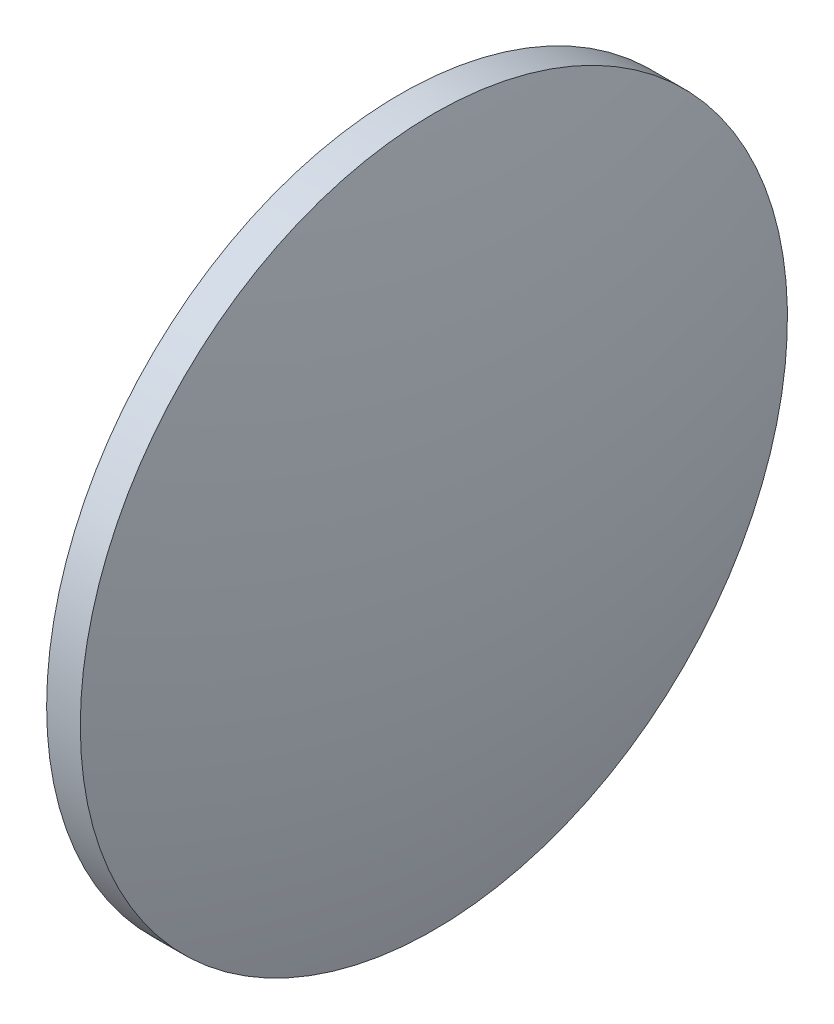
ISO-10303-21;
HEADER;
FILE_DESCRIPTION(('STEP AP214'),'2;1');
FILE_NAME('part.step','',(''),(''),'','','');
FILE_SCHEMA(('AUTOMOTIVE_DESIGN { 1 0 10303 214 1 1 1 1 }'));
ENDSEC;
DATA;
#1=APPLICATION_CONTEXT('core data for automotive mechanical design processes');
#2=APPLICATION_PROTOCOL_DEFINITION('international standard','automotive_design',2000,#1);
#3=PRODUCT_CONTEXT('',#1,'mechanical');
#4=PRODUCT('Part','Part','',(#3));
#5=PRODUCT_RELATED_PRODUCT_CATEGORY('part','',(#4));
#6=PRODUCT_DEFINITION_FORMATION('','',#4);
#7=PRODUCT_DEFINITION_CONTEXT('part definition',#1,'design');
#8=PRODUCT_DEFINITION('design','',#6,#7);
#9=PRODUCT_DEFINITION_SHAPE('','',#8);
#10=(LENGTH_UNIT() NAMED_UNIT(*) SI_UNIT(.MILLI.,.METRE.));
#11=(NAMED_UNIT(*) PLANE_ANGLE_UNIT() SI_UNIT($,.RADIAN.));
#12=(NAMED_UNIT(*) SI_UNIT($,.STERADIAN.) SOLID_ANGLE_UNIT());
#13=UNCERTAINTY_MEASURE_WITH_UNIT(LENGTH_MEASURE(1.E-05),#10,'distance_accuracy_value','');
#14=(GEOMETRIC_REPRESENTATION_CONTEXT(3) GLOBAL_UNCERTAINTY_ASSIGNED_CONTEXT((#13)) GLOBAL_UNIT_ASSIGNED_CONTEXT((#10,
#11,#12)) REPRESENTATION_CONTEXT('',''));
#15=CARTESIAN_POINT('',(0.,0.,0.));
#16=DIRECTION('',(0.,0.,1.));
#17=DIRECTION('',(1.,0.,0.));
#18=AXIS2_PLACEMENT_3D('',#15,#16,#17);
#19=CARTESIAN_POINT('',(344.84011655724,57.8954623100923,0.));
#20=DIRECTION('',(-1.,0.,0.));
#21=DIRECTION('',(0.,1.,0.));
#22=AXIS2_PLACEMENT_3D('',#19,#20,#21);
#23=SPHERICAL_SURFACE('',#22,129.161538461538);
#24=CARTESIAN_POINT('',(470.101655018778,57.8954623100924,0.));
#25=DIRECTION('',(-1.,0.,0.));
#26=DIRECTION('',(0.,0.,1.));
#27=AXIS2_PLACEMENT_3D('',#24,#25,#26);
#28=CIRCLE('',#27,31.5);
#29=CARTESIAN_POINT('',(470.101655018778,57.8954623100924,31.5));
#30=VERTEX_POINT('',#29);
#31=EDGE_CURVE('E10',#30,#30,#28,.T.);
#32=ORIENTED_EDGE('',*,*,#31,.F.);
#33=EDGE_LOOP('',(#32));
#34=FACE_BOUND('',#33,.T.);
#35=ADVANCED_FACE('F35',(#34),#23,.T.);
#36=CARTESIAN_POINT('',(458.332020754546,57.8954623100924,0.));
#37=DIRECTION('',(-1.,0.,0.));
#38=DIRECTION('',(0.,0.,1.));
#39=AXIS2_PLACEMENT_3D('',#36,#37,#38);
#40=CYLINDRICAL_SURFACE('',#39,31.5);
#41=CARTESIAN_POINT('',(467.101655018778,57.8954623100924,0.));
#42=DIRECTION('',(-1.,0.,0.));
#43=DIRECTION('',(0.,0.,1.));
#44=AXIS2_PLACEMENT_3D('',#41,#42,#43);
#45=CIRCLE('',#44,31.5);
#46=CARTESIAN_POINT('',(467.101655018778,57.8954623100924,31.5));
#47=VERTEX_POINT('',#46);
#48=EDGE_CURVE('E41',#47,#47,#45,.T.);
#49=ORIENTED_EDGE('',*,*,#48,.F.);
#50=EDGE_LOOP('',(#49));
#51=FACE_BOUND('',#50,.T.);
#52=ORIENTED_EDGE('',*,*,#31,.T.);
#53=EDGE_LOOP('',(#52));
#54=FACE_BOUND('',#53,.T.);
#55=ADVANCED_FACE('F49',(#51,#54),#40,.T.);
#56=CARTESIAN_POINT('',(467.101655018778,57.8954623100924,0.));
#57=DIRECTION('',(1.,0.,0.));
#58=DIRECTION('',(0.,0.,-1.));
#59=AXIS2_PLACEMENT_3D('',#56,#57,#58);
#60=PLANE('',#59);
#61=ORIENTED_EDGE('',*,*,#48,.T.);
#62=EDGE_LOOP('',(#61));
#63=FACE_BOUND('',#62,.T.);
#64=ADVANCED_FACE('F47',(#63),#60,.F.);
#65=CLOSED_SHELL('',(#35,#55,#64));
#66=MANIFOLD_SOLID_BREP('B2',#65);
#67=ADVANCED_BREP_SHAPE_REPRESENTATION('',(#18,#66),#14);
#68=SHAPE_DEFINITION_REPRESENTATION(#9,#67);
ENDSEC;
END-ISO-10303-21;
